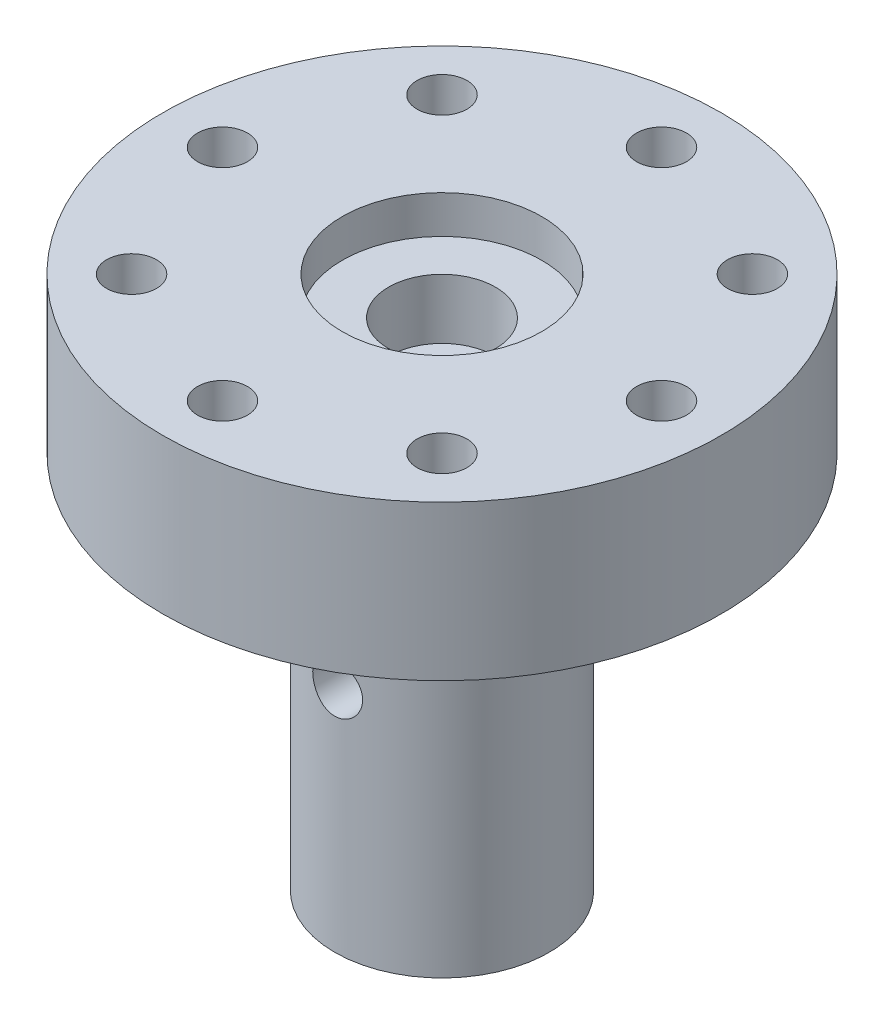
ISO-10303-21;
HEADER;
FILE_DESCRIPTION(('STEP AP214'),'2;1');
FILE_NAME('part.step','',(''),(''),'','','');
FILE_SCHEMA(('AUTOMOTIVE_DESIGN { 1 0 10303 214 1 1 1 1 }'));
ENDSEC;
DATA;
#1=APPLICATION_CONTEXT('core data for automotive mechanical design processes');
#2=APPLICATION_PROTOCOL_DEFINITION('international standard','automotive_design',2000,#1);
#3=PRODUCT_CONTEXT('',#1,'mechanical');
#4=PRODUCT('Part','Part','',(#3));
#5=PRODUCT_RELATED_PRODUCT_CATEGORY('part','',(#4));
#6=PRODUCT_DEFINITION_FORMATION('','',#4);
#7=PRODUCT_DEFINITION_CONTEXT('part definition',#1,'design');
#8=PRODUCT_DEFINITION('design','',#6,#7);
#9=PRODUCT_DEFINITION_SHAPE('','',#8);
#10=(LENGTH_UNIT() NAMED_UNIT(*) SI_UNIT(.MILLI.,.METRE.));
#11=(NAMED_UNIT(*) PLANE_ANGLE_UNIT() SI_UNIT($,.RADIAN.));
#12=(NAMED_UNIT(*) SI_UNIT($,.STERADIAN.) SOLID_ANGLE_UNIT());
#13=UNCERTAINTY_MEASURE_WITH_UNIT(LENGTH_MEASURE(1.E-05),#10,'distance_accuracy_value','');
#14=(GEOMETRIC_REPRESENTATION_CONTEXT(3) GLOBAL_UNCERTAINTY_ASSIGNED_CONTEXT((#13)) GLOBAL_UNIT_ASSIGNED_CONTEXT((#10,
#11,#12)) REPRESENTATION_CONTEXT('',''));
#15=CARTESIAN_POINT('',(0.,0.,0.));
#16=DIRECTION('',(0.,0.,1.));
#17=DIRECTION('',(1.,0.,0.));
#18=AXIS2_PLACEMENT_3D('',#15,#16,#17);
#19=CARTESIAN_POINT('',(0.,0.,0.));
#20=DIRECTION('',(0.,1.,0.));
#21=DIRECTION('',(0.,0.,1.));
#22=AXIS2_PLACEMENT_3D('',#19,#20,#21);
#23=PLANE('',#22);
#24=CARTESIAN_POINT('',(-11.,0.,0.));
#25=DIRECTION('',(0.,1.,0.));
#26=DIRECTION('',(0.,0.,1.));
#27=AXIS2_PLACEMENT_3D('',#24,#25,#26);
#28=CIRCLE('',#27,1.25);
#29=CARTESIAN_POINT('',(-11.,0.,1.25));
#30=VERTEX_POINT('',#29);
#31=EDGE_CURVE('E151',#30,#30,#28,.T.);
#32=ORIENTED_EDGE('',*,*,#31,.T.);
#33=EDGE_LOOP('',(#32));
#34=FACE_BOUND('',#33,.T.);
#35=CARTESIAN_POINT('',(-1.15218884181823E-13,0.,11.));
#36=DIRECTION('',(0.,1.,0.));
#37=DIRECTION('',(0.,0.,1.));
#38=AXIS2_PLACEMENT_3D('',#35,#36,#37);
#39=CIRCLE('',#38,1.25);
#40=CARTESIAN_POINT('',(-1.15218884181823E-13,0.,12.25));
#41=VERTEX_POINT('',#40);
#42=EDGE_CURVE('E161',#41,#41,#39,.T.);
#43=ORIENTED_EDGE('',*,*,#42,.T.);
#44=EDGE_LOOP('',(#43));
#45=FACE_BOUND('',#44,.T.);
#46=CARTESIAN_POINT('',(11.,0.,0.));
#47=DIRECTION('',(0.,1.,0.));
#48=DIRECTION('',(0.,0.,1.));
#49=AXIS2_PLACEMENT_3D('',#46,#47,#48);
#50=CIRCLE('',#49,1.25);
#51=CARTESIAN_POINT('',(11.,0.,1.25000000000008));
#52=VERTEX_POINT('',#51);
#53=EDGE_CURVE('E173',#52,#52,#50,.T.);
#54=ORIENTED_EDGE('',*,*,#53,.T.);
#55=EDGE_LOOP('',(#54));
#56=FACE_BOUND('',#55,.T.);
#57=CARTESIAN_POINT('',(0.,0.,-11.));
#58=DIRECTION('',(0.,1.,0.));
#59=DIRECTION('',(0.,0.,1.));
#60=AXIS2_PLACEMENT_3D('',#57,#58,#59);
#61=CIRCLE('',#60,1.25);
#62=CARTESIAN_POINT('',(0.,0.,-9.75));
#63=VERTEX_POINT('',#62);
#64=EDGE_CURVE('E185',#63,#63,#61,.T.);
#65=ORIENTED_EDGE('',*,*,#64,.T.);
#66=EDGE_LOOP('',(#65));
#67=FACE_BOUND('',#66,.T.);
#68=CARTESIAN_POINT('',(0.,0.,0.));
#69=DIRECTION('',(0.,1.,0.));
#70=DIRECTION('',(0.,0.,1.));
#71=AXIS2_PLACEMENT_3D('',#68,#69,#70);
#72=CIRCLE('',#71,14.);
#73=CARTESIAN_POINT('',(0.,0.,14.));
#74=VERTEX_POINT('',#73);
#75=EDGE_CURVE('E52',#74,#74,#72,.T.);
#76=ORIENTED_EDGE('',*,*,#75,.F.);
#77=EDGE_LOOP('',(#76));
#78=FACE_BOUND('',#77,.T.);
#79=CARTESIAN_POINT('',(-7.77817459305201,0.,-7.77817459305203));
#80=DIRECTION('',(0.,1.,0.));
#81=DIRECTION('',(0.,0.,1.));
#82=AXIS2_PLACEMENT_3D('',#79,#80,#81);
#83=CIRCLE('',#82,1.25);
#84=CARTESIAN_POINT('',(-7.77817459305201,0.,-6.52817459305203));
#85=VERTEX_POINT('',#84);
#86=EDGE_CURVE('E191',#85,#85,#83,.T.);
#87=ORIENTED_EDGE('',*,*,#86,.T.);
#88=EDGE_LOOP('',(#87));
#89=FACE_BOUND('',#88,.T.);
#90=CARTESIAN_POINT('',(7.77817459305206,0.,-7.77817459305199));
#91=DIRECTION('',(0.,1.,0.));
#92=DIRECTION('',(0.,0.,1.));
#93=AXIS2_PLACEMENT_3D('',#90,#91,#92);
#94=CIRCLE('',#93,1.25);
#95=CARTESIAN_POINT('',(7.77817459305206,0.,-6.52817459305199));
#96=VERTEX_POINT('',#95);
#97=EDGE_CURVE('E179',#96,#96,#94,.T.);
#98=ORIENTED_EDGE('',*,*,#97,.T.);
#99=EDGE_LOOP('',(#98));
#100=FACE_BOUND('',#99,.T.);
#101=CARTESIAN_POINT('',(7.77817459305195,0.,7.77817459305209));
#102=DIRECTION('',(0.,1.,0.));
#103=DIRECTION('',(0.,0.,1.));
#104=AXIS2_PLACEMENT_3D('',#101,#102,#103);
#105=CIRCLE('',#104,1.25);
#106=CARTESIAN_POINT('',(7.77817459305195,0.,9.02817459305209));
#107=VERTEX_POINT('',#106);
#108=EDGE_CURVE('E167',#107,#107,#105,.T.);
#109=ORIENTED_EDGE('',*,*,#108,.T.);
#110=EDGE_LOOP('',(#109));
#111=FACE_BOUND('',#110,.T.);
#112=CARTESIAN_POINT('',(-7.77817459305212,0.,7.77817459305193));
#113=DIRECTION('',(0.,1.,0.));
#114=DIRECTION('',(0.,0.,1.));
#115=AXIS2_PLACEMENT_3D('',#112,#113,#114);
#116=CIRCLE('',#115,1.25);
#117=CARTESIAN_POINT('',(-7.77817459305212,0.,9.02817459305193));
#118=VERTEX_POINT('',#117);
#119=EDGE_CURVE('E156',#118,#118,#116,.T.);
#120=ORIENTED_EDGE('',*,*,#119,.T.);
#121=EDGE_LOOP('',(#120));
#122=FACE_BOUND('',#121,.T.);
#123=CARTESIAN_POINT('',(0.,0.,0.));
#124=DIRECTION('',(0.,1.,0.));
#125=DIRECTION('',(0.,0.,1.));
#126=AXIS2_PLACEMENT_3D('',#123,#124,#125);
#127=CIRCLE('',#126,5.375);
#128=CARTESIAN_POINT('',(0.,0.,5.375));
#129=VERTEX_POINT('',#128);
#130=EDGE_CURVE('E10',#129,#129,#127,.F.);
#131=ORIENTED_EDGE('',*,*,#130,.F.);
#132=EDGE_LOOP('',(#131));
#133=FACE_BOUND('',#132,.T.);
#134=ADVANCED_FACE('F34',(#34,#45,#56,#67,#78,#89,#100,#111,#122,#133),#23,.F.);
#135=CARTESIAN_POINT('',(0.,7.75,0.));
#136=DIRECTION('',(0.,1.,0.));
#137=DIRECTION('',(0.,0.,1.));
#138=AXIS2_PLACEMENT_3D('',#135,#136,#137);
#139=PLANE('',#138);
#140=CARTESIAN_POINT('',(0.,7.75,0.));
#141=DIRECTION('',(0.,1.,0.));
#142=DIRECTION('',(0.,0.,1.));
#143=AXIS2_PLACEMENT_3D('',#140,#141,#142);
#144=CIRCLE('',#143,5.);
#145=CARTESIAN_POINT('',(0.,7.75,5.));
#146=VERTEX_POINT('',#145);
#147=EDGE_CURVE('E139',#146,#146,#144,.T.);
#148=ORIENTED_EDGE('',*,*,#147,.F.);
#149=EDGE_LOOP('',(#148));
#150=FACE_BOUND('',#149,.T.);
#151=CARTESIAN_POINT('',(-7.77817459305212,7.75,7.77817459305193));
#152=DIRECTION('',(0.,1.,0.));
#153=DIRECTION('',(0.,0.,1.));
#154=AXIS2_PLACEMENT_3D('',#151,#152,#153);
#155=CIRCLE('',#154,1.25);
#156=CARTESIAN_POINT('',(-7.77817459305212,7.75,9.02817459305193));
#157=VERTEX_POINT('',#156);
#158=EDGE_CURVE('E158',#157,#157,#155,.T.);
#159=ORIENTED_EDGE('',*,*,#158,.F.);
#160=EDGE_LOOP('',(#159));
#161=FACE_BOUND('',#160,.T.);
#162=CARTESIAN_POINT('',(7.77817459305195,7.75,7.77817459305209));
#163=DIRECTION('',(0.,1.,0.));
#164=DIRECTION('',(0.,0.,1.));
#165=AXIS2_PLACEMENT_3D('',#162,#163,#164);
#166=CIRCLE('',#165,1.25);
#167=CARTESIAN_POINT('',(7.77817459305195,7.75,9.02817459305209));
#168=VERTEX_POINT('',#167);
#169=EDGE_CURVE('E170',#168,#168,#166,.T.);
#170=ORIENTED_EDGE('',*,*,#169,.F.);
#171=EDGE_LOOP('',(#170));
#172=FACE_BOUND('',#171,.T.);
#173=CARTESIAN_POINT('',(7.77817459305206,7.75,-7.77817459305199));
#174=DIRECTION('',(0.,1.,0.));
#175=DIRECTION('',(0.,0.,1.));
#176=AXIS2_PLACEMENT_3D('',#173,#174,#175);
#177=CIRCLE('',#176,1.25);
#178=CARTESIAN_POINT('',(7.77817459305206,7.75,-6.52817459305199));
#179=VERTEX_POINT('',#178);
#180=EDGE_CURVE('E182',#179,#179,#177,.T.);
#181=ORIENTED_EDGE('',*,*,#180,.F.);
#182=EDGE_LOOP('',(#181));
#183=FACE_BOUND('',#182,.T.);
#184=CARTESIAN_POINT('',(-7.77817459305201,7.75,-7.77817459305203));
#185=DIRECTION('',(0.,1.,0.));
#186=DIRECTION('',(0.,0.,1.));
#187=AXIS2_PLACEMENT_3D('',#184,#185,#186);
#188=CIRCLE('',#187,1.25);
#189=CARTESIAN_POINT('',(-7.77817459305201,7.75,-6.52817459305203));
#190=VERTEX_POINT('',#189);
#191=EDGE_CURVE('E194',#190,#190,#188,.T.);
#192=ORIENTED_EDGE('',*,*,#191,.F.);
#193=EDGE_LOOP('',(#192));
#194=FACE_BOUND('',#193,.T.);
#195=CARTESIAN_POINT('',(0.,7.75,0.));
#196=DIRECTION('',(0.,1.,0.));
#197=DIRECTION('',(0.,0.,1.));
#198=AXIS2_PLACEMENT_3D('',#195,#196,#197);
#199=CIRCLE('',#198,14.);
#200=CARTESIAN_POINT('',(0.,7.75,14.));
#201=VERTEX_POINT('',#200);
#202=EDGE_CURVE('E47',#201,#201,#199,.T.);
#203=ORIENTED_EDGE('',*,*,#202,.T.);
#204=EDGE_LOOP('',(#203));
#205=FACE_BOUND('',#204,.T.);
#206=CARTESIAN_POINT('',(0.,7.75,-11.));
#207=DIRECTION('',(0.,1.,0.));
#208=DIRECTION('',(0.,0.,1.));
#209=AXIS2_PLACEMENT_3D('',#206,#207,#208);
#210=CIRCLE('',#209,1.25);
#211=CARTESIAN_POINT('',(0.,7.75,-9.75));
#212=VERTEX_POINT('',#211);
#213=EDGE_CURVE('E188',#212,#212,#210,.T.);
#214=ORIENTED_EDGE('',*,*,#213,.F.);
#215=EDGE_LOOP('',(#214));
#216=FACE_BOUND('',#215,.T.);
#217=CARTESIAN_POINT('',(11.,7.75,0.));
#218=DIRECTION('',(0.,1.,0.));
#219=DIRECTION('',(0.,0.,1.));
#220=AXIS2_PLACEMENT_3D('',#217,#218,#219);
#221=CIRCLE('',#220,1.25);
#222=CARTESIAN_POINT('',(11.,7.75,1.25000000000008));
#223=VERTEX_POINT('',#222);
#224=EDGE_CURVE('E176',#223,#223,#221,.T.);
#225=ORIENTED_EDGE('',*,*,#224,.F.);
#226=EDGE_LOOP('',(#225));
#227=FACE_BOUND('',#226,.T.);
#228=CARTESIAN_POINT('',(-1.15218884181823E-13,7.75,11.));
#229=DIRECTION('',(0.,1.,0.));
#230=DIRECTION('',(0.,0.,1.));
#231=AXIS2_PLACEMENT_3D('',#228,#229,#230);
#232=CIRCLE('',#231,1.25);
#233=CARTESIAN_POINT('',(-1.15218884181823E-13,7.75,12.25));
#234=VERTEX_POINT('',#233);
#235=EDGE_CURVE('E164',#234,#234,#232,.T.);
#236=ORIENTED_EDGE('',*,*,#235,.F.);
#237=EDGE_LOOP('',(#236));
#238=FACE_BOUND('',#237,.T.);
#239=CARTESIAN_POINT('',(-11.,7.75,0.));
#240=DIRECTION('',(0.,1.,0.));
#241=DIRECTION('',(0.,0.,1.));
#242=AXIS2_PLACEMENT_3D('',#239,#240,#241);
#243=CIRCLE('',#242,1.25);
#244=CARTESIAN_POINT('',(-11.,7.75,1.25));
#245=VERTEX_POINT('',#244);
#246=EDGE_CURVE('E153',#245,#245,#243,.T.);
#247=ORIENTED_EDGE('',*,*,#246,.F.);
#248=EDGE_LOOP('',(#247));
#249=FACE_BOUND('',#248,.T.);
#250=ADVANCED_FACE('F79',(#150,#161,#172,#183,#194,#205,#216,#227,#238,#249),#139,.T.);
#251=CARTESIAN_POINT('',(0.,7.75,0.));
#252=DIRECTION('',(0.,-1.,0.));
#253=DIRECTION('',(0.,0.,-1.));
#254=AXIS2_PLACEMENT_3D('',#251,#252,#253);
#255=CYLINDRICAL_SURFACE('',#254,14.);
#256=ORIENTED_EDGE('',*,*,#202,.F.);
#257=EDGE_LOOP('',(#256));
#258=FACE_BOUND('',#257,.T.);
#259=ORIENTED_EDGE('',*,*,#75,.T.);
#260=EDGE_LOOP('',(#259));
#261=FACE_BOUND('',#260,.T.);
#262=ADVANCED_FACE('F36',(#258,#261),#255,.T.);
#263=CARTESIAN_POINT('',(-7.77817459305201,7.75,-7.77817459305203));
#264=DIRECTION('',(0.,-1.,0.));
#265=DIRECTION('',(0.,0.,-1.));
#266=AXIS2_PLACEMENT_3D('',#263,#264,#265);
#267=CYLINDRICAL_SURFACE('',#266,1.25);
#268=ORIENTED_EDGE('',*,*,#191,.T.);
#269=EDGE_LOOP('',(#268));
#270=FACE_BOUND('',#269,.T.);
#271=ORIENTED_EDGE('',*,*,#86,.F.);
#272=EDGE_LOOP('',(#271));
#273=FACE_BOUND('',#272,.T.);
#274=ADVANCED_FACE('F89',(#270,#273),#267,.F.);
#275=CARTESIAN_POINT('',(0.,7.75,-11.));
#276=DIRECTION('',(0.,-1.,0.));
#277=DIRECTION('',(0.,0.,-1.));
#278=AXIS2_PLACEMENT_3D('',#275,#276,#277);
#279=CYLINDRICAL_SURFACE('',#278,1.25);
#280=ORIENTED_EDGE('',*,*,#213,.T.);
#281=EDGE_LOOP('',(#280));
#282=FACE_BOUND('',#281,.T.);
#283=ORIENTED_EDGE('',*,*,#64,.F.);
#284=EDGE_LOOP('',(#283));
#285=FACE_BOUND('',#284,.T.);
#286=ADVANCED_FACE('F92',(#282,#285),#279,.F.);
#287=CARTESIAN_POINT('',(7.77817459305206,7.75,-7.77817459305199));
#288=DIRECTION('',(0.,-1.,0.));
#289=DIRECTION('',(0.,0.,-1.));
#290=AXIS2_PLACEMENT_3D('',#287,#288,#289);
#291=CYLINDRICAL_SURFACE('',#290,1.25);
#292=ORIENTED_EDGE('',*,*,#180,.T.);
#293=EDGE_LOOP('',(#292));
#294=FACE_BOUND('',#293,.T.);
#295=ORIENTED_EDGE('',*,*,#97,.F.);
#296=EDGE_LOOP('',(#295));
#297=FACE_BOUND('',#296,.T.);
#298=ADVANCED_FACE('F96',(#294,#297),#291,.F.);
#299=CARTESIAN_POINT('',(11.,7.75,0.));
#300=DIRECTION('',(0.,-1.,0.));
#301=DIRECTION('',(0.,0.,-1.));
#302=AXIS2_PLACEMENT_3D('',#299,#300,#301);
#303=CYLINDRICAL_SURFACE('',#302,1.25);
#304=ORIENTED_EDGE('',*,*,#224,.T.);
#305=EDGE_LOOP('',(#304));
#306=FACE_BOUND('',#305,.T.);
#307=ORIENTED_EDGE('',*,*,#53,.F.);
#308=EDGE_LOOP('',(#307));
#309=FACE_BOUND('',#308,.T.);
#310=ADVANCED_FACE('F100',(#306,#309),#303,.F.);
#311=CARTESIAN_POINT('',(7.77817459305195,7.75,7.77817459305209));
#312=DIRECTION('',(0.,-1.,0.));
#313=DIRECTION('',(0.,0.,-1.));
#314=AXIS2_PLACEMENT_3D('',#311,#312,#313);
#315=CYLINDRICAL_SURFACE('',#314,1.25);
#316=ORIENTED_EDGE('',*,*,#169,.T.);
#317=EDGE_LOOP('',(#316));
#318=FACE_BOUND('',#317,.T.);
#319=ORIENTED_EDGE('',*,*,#108,.F.);
#320=EDGE_LOOP('',(#319));
#321=FACE_BOUND('',#320,.T.);
#322=ADVANCED_FACE('F104',(#318,#321),#315,.F.);
#323=CARTESIAN_POINT('',(-1.15218884181823E-13,7.75,11.));
#324=DIRECTION('',(0.,-1.,0.));
#325=DIRECTION('',(0.,0.,-1.));
#326=AXIS2_PLACEMENT_3D('',#323,#324,#325);
#327=CYLINDRICAL_SURFACE('',#326,1.25);
#328=ORIENTED_EDGE('',*,*,#235,.T.);
#329=EDGE_LOOP('',(#328));
#330=FACE_BOUND('',#329,.T.);
#331=ORIENTED_EDGE('',*,*,#42,.F.);
#332=EDGE_LOOP('',(#331));
#333=FACE_BOUND('',#332,.T.);
#334=ADVANCED_FACE('F108',(#330,#333),#327,.F.);
#335=CARTESIAN_POINT('',(-7.77817459305212,7.75,7.77817459305193));
#336=DIRECTION('',(0.,-1.,0.));
#337=DIRECTION('',(0.,0.,-1.));
#338=AXIS2_PLACEMENT_3D('',#335,#336,#337);
#339=CYLINDRICAL_SURFACE('',#338,1.25);
#340=ORIENTED_EDGE('',*,*,#158,.T.);
#341=EDGE_LOOP('',(#340));
#342=FACE_BOUND('',#341,.T.);
#343=ORIENTED_EDGE('',*,*,#119,.F.);
#344=EDGE_LOOP('',(#343));
#345=FACE_BOUND('',#344,.T.);
#346=ADVANCED_FACE('F112',(#342,#345),#339,.F.);
#347=CARTESIAN_POINT('',(-11.,7.75,0.));
#348=DIRECTION('',(0.,-1.,0.));
#349=DIRECTION('',(0.,0.,-1.));
#350=AXIS2_PLACEMENT_3D('',#347,#348,#349);
#351=CYLINDRICAL_SURFACE('',#350,1.25);
#352=ORIENTED_EDGE('',*,*,#246,.T.);
#353=EDGE_LOOP('',(#352));
#354=FACE_BOUND('',#353,.T.);
#355=ORIENTED_EDGE('',*,*,#31,.F.);
#356=EDGE_LOOP('',(#355));
#357=FACE_BOUND('',#356,.T.);
#358=ADVANCED_FACE('F116',(#354,#357),#351,.F.);
#359=CARTESIAN_POINT('',(0.,5.85,0.));
#360=DIRECTION('',(0.,1.,0.));
#361=DIRECTION('',(0.,0.,1.));
#362=AXIS2_PLACEMENT_3D('',#359,#360,#361);
#363=CYLINDRICAL_SURFACE('',#362,5.);
#364=CARTESIAN_POINT('',(0.,5.85,0.));
#365=DIRECTION('',(0.,1.,0.));
#366=DIRECTION('',(0.,0.,1.));
#367=AXIS2_PLACEMENT_3D('',#364,#365,#366);
#368=CIRCLE('',#367,5.);
#369=CARTESIAN_POINT('',(0.,5.85,5.));
#370=VERTEX_POINT('',#369);
#371=EDGE_CURVE('E143',#370,#370,#368,.T.);
#372=ORIENTED_EDGE('',*,*,#371,.F.);
#373=EDGE_LOOP('',(#372));
#374=FACE_BOUND('',#373,.T.);
#375=ORIENTED_EDGE('',*,*,#147,.T.);
#376=EDGE_LOOP('',(#375));
#377=FACE_BOUND('',#376,.T.);
#378=ADVANCED_FACE('F120',(#374,#377),#363,.F.);
#379=CARTESIAN_POINT('',(0.,5.85,0.));
#380=DIRECTION('',(0.,1.,0.));
#381=DIRECTION('',(0.,0.,1.));
#382=AXIS2_PLACEMENT_3D('',#379,#380,#381);
#383=PLANE('',#382);
#384=CARTESIAN_POINT('',(0.,5.85,0.));
#385=DIRECTION('',(0.,1.,0.));
#386=DIRECTION('',(0.,0.,1.));
#387=AXIS2_PLACEMENT_3D('',#384,#385,#386);
#388=CIRCLE('',#387,2.675);
#389=CARTESIAN_POINT('',(0.,5.85,2.675));
#390=VERTEX_POINT('',#389);
#391=EDGE_CURVE('E140',#390,#390,#388,.T.);
#392=ORIENTED_EDGE('',*,*,#391,.F.);
#393=EDGE_LOOP('',(#392));
#394=FACE_BOUND('',#393,.T.);
#395=ORIENTED_EDGE('',*,*,#371,.T.);
#396=EDGE_LOOP('',(#395));
#397=FACE_BOUND('',#396,.T.);
#398=ADVANCED_FACE('F124',(#394,#397),#383,.T.);
#399=CARTESIAN_POINT('',(0.,2.85,0.));
#400=DIRECTION('',(0.,1.,0.));
#401=DIRECTION('',(0.,0.,1.));
#402=AXIS2_PLACEMENT_3D('',#399,#400,#401);
#403=CYLINDRICAL_SURFACE('',#402,2.675);
#404=CARTESIAN_POINT('',(0.,2.85,0.));
#405=DIRECTION('',(0.,1.,0.));
#406=DIRECTION('',(0.,0.,1.));
#407=AXIS2_PLACEMENT_3D('',#404,#405,#406);
#408=CIRCLE('',#407,2.675);
#409=CARTESIAN_POINT('',(0.,2.85,2.675));
#410=VERTEX_POINT('',#409);
#411=EDGE_CURVE('E138',#410,#410,#408,.T.);
#412=ORIENTED_EDGE('',*,*,#411,.F.);
#413=EDGE_LOOP('',(#412));
#414=FACE_BOUND('',#413,.T.);
#415=ORIENTED_EDGE('',*,*,#391,.T.);
#416=EDGE_LOOP('',(#415));
#417=FACE_BOUND('',#416,.T.);
#418=ADVANCED_FACE('F128',(#414,#417),#403,.F.);
#419=CARTESIAN_POINT('',(0.,2.85,0.));
#420=DIRECTION('',(0.,1.,0.));
#421=DIRECTION('',(0.,0.,1.));
#422=AXIS2_PLACEMENT_3D('',#419,#420,#421);
#423=PLANE('',#422);
#424=ORIENTED_EDGE('',*,*,#411,.T.);
#425=EDGE_LOOP('',(#424));
#426=FACE_BOUND('',#425,.T.);
#427=ADVANCED_FACE('F75',(#426),#423,.T.);
#428=CARTESIAN_POINT('',(0.,-19.,0.));
#429=DIRECTION('',(0.,1.,0.));
#430=DIRECTION('',(0.,0.,1.));
#431=AXIS2_PLACEMENT_3D('',#428,#429,#430);
#432=CYLINDRICAL_SURFACE('',#431,5.375);
#433=CARTESIAN_POINT('',(0.,-8.75,5.375));
#434=CARTESIAN_POINT('',(-0.0692151507875184,-8.7499978025309,5.37499875159576));
#435=CARTESIAN_POINT('',(-0.138455956736741,-8.74423173051015,5.37364957601175));
#436=CARTESIAN_POINT('',(-0.274963229392266,-8.72134823846589,5.36839792851223));
#437=CARTESIAN_POINT('',(-0.342228380276212,-8.70422342465732,5.3644937935103));
#438=CARTESIAN_POINT('',(-0.47279246909182,-8.65919380930274,5.35456591410619));
#439=CARTESIAN_POINT('',(-0.536095726882453,-8.63130099532277,5.34854452741455));
#440=CARTESIAN_POINT('',(-0.65712302733579,-8.56556700357688,5.33502833023856));
#441=CARTESIAN_POINT('',(-0.714847069776669,-8.52772582541541,5.32753351969561));
#442=CARTESIAN_POINT('',(-0.82411767932015,-8.44244896995872,5.3117375273922));
#443=CARTESIAN_POINT('',(-0.875549458901755,-8.39486824718393,5.30342527996824));
#444=CARTESIAN_POINT('',(-0.969779244250178,-8.29177397256851,5.2870072881596));
#445=CARTESIAN_POINT('',(-1.01257639711149,-8.23625963799111,5.27890156424379));
#446=CARTESIAN_POINT('',(-1.08884272508293,-8.11800711008904,5.26370428272459));
#447=CARTESIAN_POINT('',(-1.122187054859,-8.05518641966315,5.25662685117825));
#448=CARTESIAN_POINT('',(-1.17779954036633,-7.92464094384012,5.24444745901717));
#449=CARTESIAN_POINT('',(-1.20006920803617,-7.85691682931684,5.23934522876444));
#450=CARTESIAN_POINT('',(-1.23251560906288,-7.71973961753334,5.2318071002124));
#451=CARTESIAN_POINT('',(-1.24289695564103,-7.65033744805585,5.22932614611082));
#452=CARTESIAN_POINT('',(-1.25190874128498,-7.51073562534051,5.22717635501667));
#453=CARTESIAN_POINT('',(-1.25054082146171,-7.44053608484554,5.22750712528875));
#454=CARTESIAN_POINT('',(-1.23625696098787,-7.30287312046419,5.23090274142344));
#455=CARTESIAN_POINT('',(-1.22358128455204,-7.2353831482708,5.23391070005962));
#456=CARTESIAN_POINT('',(-1.18742349566998,-7.10351477953371,5.24223152686078));
#457=CARTESIAN_POINT('',(-1.16394070657715,-7.03913657810075,5.24754453934681));
#458=CARTESIAN_POINT('',(-1.10662151135297,-6.91465713559703,5.25993123752095));
#459=CARTESIAN_POINT('',(-1.07269494932043,-6.85459898726474,5.26702015035257));
#460=CARTESIAN_POINT('',(-0.995514496684479,-6.74094037323062,5.28215089234227));
#461=CARTESIAN_POINT('',(-0.952259179024089,-6.68734089749527,5.29019286720917));
#462=CARTESIAN_POINT('',(-0.85638886172877,-6.58674048835362,5.30656575957393));
#463=CARTESIAN_POINT('',(-0.803570198890892,-6.53993379387511,5.3148989243812));
#464=CARTESIAN_POINT('',(-0.690736062170002,-6.45580853851922,5.33073627503209));
#465=CARTESIAN_POINT('',(-0.630720422805096,-6.41849019587148,5.33824044180673));
#466=CARTESIAN_POINT('',(-0.504941835859097,-6.35434315943301,5.35160386178591));
#467=CARTESIAN_POINT('',(-0.43916408642512,-6.32754251139414,5.3574587054603));
#468=CARTESIAN_POINT('',(-0.303871544378256,-6.28543045650119,5.3668313901215));
#469=CARTESIAN_POINT('',(-0.234357369928456,-6.27011715538449,5.37034961640536));
#470=CARTESIAN_POINT('',(-0.0952290121857286,-6.25170300814094,5.37459688291296));
#471=CARTESIAN_POINT('',(-0.025651696845909,-6.24833719077728,5.37538642917406));
#472=CARTESIAN_POINT('',(0.113071309495127,-6.25319171444632,5.3742581143193));
#473=CARTESIAN_POINT('',(0.18221703340258,-6.26141116106119,5.37234046220743));
#474=CARTESIAN_POINT('',(0.317217837058148,-6.28898365879917,5.36605166320075));
#475=CARTESIAN_POINT('',(0.383103370534299,-6.30819534709708,5.36171168503793));
#476=CARTESIAN_POINT('',(0.510715394590336,-6.35704813126426,5.35106517330135));
#477=CARTESIAN_POINT('',(0.572441500060785,-6.38669019127502,5.34475845793648));
#478=CARTESIAN_POINT('',(0.691060582292075,-6.4560977987617,5.33073045297445));
#479=CARTESIAN_POINT('',(0.747861769182145,-6.49601592069626,5.32298838444375));
#480=CARTESIAN_POINT('',(0.854054068349471,-6.5846441797903,5.30698648156409));
#481=CARTESIAN_POINT('',(0.903444081598189,-6.63335561858621,5.29872657067948));
#482=CARTESIAN_POINT('',(0.994478847710012,-6.73941034024425,5.28240709620801));
#483=CARTESIAN_POINT('',(1.03593901887591,-6.7969135108285,5.27435539090911));
#484=CARTESIAN_POINT('',(1.10861684709578,-6.91822068380326,5.25956031697033));
#485=CARTESIAN_POINT('',(1.13983496068385,-6.98202440518521,5.25281689002014));
#486=CARTESIAN_POINT('',(1.19091990903248,-7.11377322580029,5.2414711614034));
#487=CARTESIAN_POINT('',(1.21085295728779,-7.18169152381724,5.236856400335));
#488=CARTESIAN_POINT('',(1.23898888372022,-7.32003650748142,5.23027190554712));
#489=CARTESIAN_POINT('',(1.24719392433216,-7.39046272825755,5.22830168422589));
#490=CARTESIAN_POINT('',(1.25153973194479,-7.52995635750029,5.22726287112187));
#491=CARTESIAN_POINT('',(1.24797409140692,-7.59901425103841,5.22812366420748));
#492=CARTESIAN_POINT('',(1.22954275309423,-7.73551569563618,5.23248866490602));
#493=CARTESIAN_POINT('',(1.21467722619878,-7.80295927109198,5.23599283254526));
#494=CARTESIAN_POINT('',(1.17421809290322,-7.93404767410398,5.24521316682076));
#495=CARTESIAN_POINT('',(1.1486725000026,-7.99770806440233,5.25091942497235));
#496=CARTESIAN_POINT('',(1.08761782054051,-8.11988112782559,5.2639037122052));
#497=CARTESIAN_POINT('',(1.05210754397903,-8.17839318503061,5.2711819289886));
#498=CARTESIAN_POINT('',(0.971180588478164,-8.29004391984119,5.28669691942429));
#499=CARTESIAN_POINT('',(0.925556988894283,-8.34303013843883,5.29495172792319));
#500=CARTESIAN_POINT('',(0.826111068605686,-8.44069041608503,5.31137463958233));
#501=CARTESIAN_POINT('',(0.772286837866884,-8.48536253327186,5.31954272206761));
#502=CARTESIAN_POINT('',(0.656987722383672,-8.56577747734228,5.33501850182159));
#503=CARTESIAN_POINT('',(0.595409645644401,-8.60137538930645,5.34231135596834));
#504=CARTESIAN_POINT('',(0.46698357330058,-8.66165811880061,5.35506311977135));
#505=CARTESIAN_POINT('',(0.40013977646351,-8.68635152959375,5.36052347270783));
#506=CARTESIAN_POINT('',(0.277753131460168,-8.7200334011924,5.36809110179261));
#507=CARTESIAN_POINT('',(0.22284097782472,-8.73124825503955,5.37066516026247));
#508=CARTESIAN_POINT('',(0.111958105122188,-8.74623223410712,5.37412006672818));
#509=CARTESIAN_POINT('',(0.0559874456868497,-8.75000177751085,5.37500100982175));
#510=CARTESIAN_POINT('',(0.,-8.75,5.375));
#511=B_SPLINE_CURVE_WITH_KNOTS('',3,(#433,#434,#435,#436,#437,#438,#439,#440,#441,#442,#443,
#444,#445,#446,#447,#448,#449,#450,#451,#452,#453,#454,#455,#456,#457,#458,#459,#460,#461,#462,
#463,#464,#465,#466,#467,#468,#469,#470,#471,#472,#473,#474,#475,#476,#477,#478,#479,#480,#481,
#482,#483,#484,#485,#486,#487,#488,#489,#490,#491,#492,#493,#494,#495,#496,#497,#498,#499,#500,
#501,#502,#503,#504,#505,#506,#507,#508,#509,#510),.UNSPECIFIED.,.T.,.F.,(4,2,2,2,2,2,2,2,2,2,2,
2,2,2,2,2,2,2,2,2,2,2,2,2,2,2,2,2,2,2,2,2,2,2,2,2,2,2,4),(0.,0.207440417103945,
0.415015996803991,0.62236115455932,0.829706320558518,1.04039922313264,1.2511129272142,
1.46449211731239,1.67784216838555,1.887462233859,2.09705302055257,2.30229382661907,
2.50754748481328,2.71462518988682,2.92173459496075,3.1339271935358,3.34612467204454,
3.55888419817218,3.77160863255363,3.9795847243529,4.187544760641,4.39288863582478,
4.59825149715664,4.80685961033016,5.01549862821383,5.22852225725064,5.4415363895857,
5.65328738316594,5.86499932861198,6.0714708987445,6.27793934663075,6.48348940590648,
6.6890640227853,6.89931369625044,7.10961241468294,7.32308453516627,7.53638812799018,
7.70419403955388,7.87199052563708),.UNSPECIFIED.);
#512=CARTESIAN_POINT('',(0.,-8.75,5.375));
#513=VERTEX_POINT('',#512);
#514=EDGE_CURVE('E38',#513,#513,#511,.T.);
#515=ORIENTED_EDGE('',*,*,#514,.T.);
#516=EDGE_LOOP('',(#515));
#517=FACE_BOUND('',#516,.T.);
#518=CARTESIAN_POINT('',(1.25,-7.5,-5.22763091658162));
#519=CARTESIAN_POINT('',(1.24999778347903,-7.43081338462086,-5.22763230124413));
#520=CARTESIAN_POINT('',(1.24423630278213,-7.36160106974779,-5.22901940032487));
#521=CARTESIAN_POINT('',(1.2213726981515,-7.22515292404002,-5.23440605446415));
#522=CARTESIAN_POINT('',(1.20426306260307,-7.15791843318024,-5.23840733988878));
#523=CARTESIAN_POINT('',(1.15927780925659,-7.02741933353806,-5.24854524685445));
#524=CARTESIAN_POINT('',(1.13141488887832,-6.9641501445858,-5.25467934913382));
#525=CARTESIAN_POINT('',(1.06575139892513,-6.84318045286964,-5.26838865902693));
#526=CARTESIAN_POINT('',(1.02795076275511,-6.78547998742667,-5.27596387629785));
#527=CARTESIAN_POINT('',(0.942715785204503,-6.67618496002803,-5.29186341835914));
#528=CARTESIAN_POINT('',(0.895127277906659,-6.6247121492262,-5.30019836616819));
#529=CARTESIAN_POINT('',(0.791999928596098,-6.53040254562183,-5.31658560025749));
#530=CARTESIAN_POINT('',(0.736460417828374,-6.48756647998234,-5.3246378626902));
#531=CARTESIAN_POINT('',(0.618183655154112,-6.41125763320687,-5.33966895039391));
#532=CARTESIAN_POINT('',(0.555368224386914,-6.37790303215156,-5.34663377727743));
#533=CARTESIAN_POINT('',(0.424834066609954,-6.32227013324566,-5.3585847385408));
#534=CARTESIAN_POINT('',(0.357115964412602,-6.29999042681121,-5.36357112453654));
#535=CARTESIAN_POINT('',(0.219966199931173,-6.26752570913751,-5.37092829221228));
#536=CARTESIAN_POINT('',(0.150585819872227,-6.25713432652508,-5.37334365155583));
#537=CARTESIAN_POINT('',(0.011027331365955,-6.24809490451041,-5.37544145142493));
#538=CARTESIAN_POINT('',(-0.0591506732672573,-6.24944535395125,-5.375124243628));
#539=CARTESIAN_POINT('',(-0.19688598162701,-6.26369980779501,-5.37182634158832));
#540=CARTESIAN_POINT('',(-0.264467730792642,-6.27638124075534,-5.36889695978885));
#541=CARTESIAN_POINT('',(-0.396516596776354,-6.31258169632147,-5.36076285399525));
#542=CARTESIAN_POINT('',(-0.460983561158552,-6.33610124874662,-5.35555801876665));
#543=CARTESIAN_POINT('',(-0.585577255041267,-6.39349993768058,-5.34337701123399));
#544=CARTESIAN_POINT('',(-0.645664717578549,-6.42746122381631,-5.33638686976437));
#545=CARTESIAN_POINT('',(-0.759367607659788,-6.50471766073246,-5.32139827385208));
#546=CARTESIAN_POINT('',(-0.812982045569571,-6.54801423593512,-5.31339966561025));
#547=CARTESIAN_POINT('',(-0.913542513947872,-6.64391620975245,-5.29704870110869));
#548=CARTESIAN_POINT('',(-0.960302397348203,-6.69671632130281,-5.28869244859633));
#549=CARTESIAN_POINT('',(-1.04434172554157,-6.80949589572208,-5.27274220502987));
#550=CARTESIAN_POINT('',(-1.08162084071429,-6.86947560809945,-5.26514824048398));
#551=CARTESIAN_POINT('',(-1.14573839237506,-6.9952398872415,-5.25157039701963));
#552=CARTESIAN_POINT('',(-1.17253757508656,-7.0610451673224,-5.24559259693624));
#553=CARTESIAN_POINT('',(-1.21463849952018,-7.19639817518247,-5.23600510574022));
#554=CARTESIAN_POINT('',(-1.22994233164607,-7.26594522006388,-5.23239498408572));
#555=CARTESIAN_POINT('',(-1.24832089430714,-7.40509578621641,-5.22804054181781));
#556=CARTESIAN_POINT('',(-1.25166845258668,-7.47466131577793,-5.22723229855295));
#557=CARTESIAN_POINT('',(-1.24678163745835,-7.61335656687351,-5.22840001935786));
#558=CARTESIAN_POINT('',(-1.23854817305386,-7.68248632218403,-5.23037576491023));
#559=CARTESIAN_POINT('',(-1.21097085422465,-7.81737105695104,-5.23682809669174));
#560=CARTESIAN_POINT('',(-1.19178089520811,-7.88315931385132,-5.24127001953437));
#561=CARTESIAN_POINT('',(-1.14300364035633,-8.01058627229767,-5.2521222431034));
#562=CARTESIAN_POINT('',(-1.11341524511984,-8.07222453425349,-5.25853275195453));
#563=CARTESIAN_POINT('',(-1.04409285184369,-8.19077197902784,-5.27273777995701));
#564=CARTESIAN_POINT('',(-1.00419289669985,-8.24758143187228,-5.28055423387871));
#565=CARTESIAN_POINT('',(-0.915593993390447,-8.35379869070764,-5.29663434800311));
#566=CARTESIAN_POINT('',(-0.866893802453078,-8.40320544948312,-5.3048980712537));
#567=CARTESIAN_POINT('',(-0.760834683593613,-8.49429345790518,-5.32115486563822));
#568=CARTESIAN_POINT('',(-0.703313271792079,-8.535787518466,-5.32913840875055));
#569=CARTESIAN_POINT('',(-0.581958914708238,-8.60852482042148,-5.34375133153831));
#570=CARTESIAN_POINT('',(-0.518126282498716,-8.63976856995877,-5.35038077833473));
#571=CARTESIAN_POINT('',(-0.386382166975894,-8.69086754791278,-5.36149882933157));
#572=CARTESIAN_POINT('',(-0.318501819970505,-8.71079976612134,-5.36600187036231));
#573=CARTESIAN_POINT('',(-0.180238248707514,-8.7389468216929,-5.3724225180654));
#574=CARTESIAN_POINT('',(-0.109855440607666,-8.7471635980718,-5.37434055257778));
#575=CARTESIAN_POINT('',(0.0296462760794785,-8.75154990813487,-5.37536033332193));
#576=CARTESIAN_POINT('',(0.0987561100322969,-8.74799748501603,-5.37452707935508));
#577=CARTESIAN_POINT('',(0.235365023813947,-8.72957452562812,-5.37027925059152));
#578=CARTESIAN_POINT('',(0.302864140227189,-8.71470424667564,-5.36686473448099));
#579=CARTESIAN_POINT('',(0.434087841530432,-8.67420802597031,-5.35784513640643));
#580=CARTESIAN_POINT('',(0.49782669809371,-8.64862619867007,-5.3522490454888));
#581=CARTESIAN_POINT('',(0.620142024079253,-8.58747441099571,-5.33946016952536));
#582=CARTESIAN_POINT('',(0.678717923845812,-8.55190335026583,-5.33226720859595));
#583=CARTESIAN_POINT('',(0.790385131780865,-8.47090121166638,-5.31687537508157));
#584=CARTESIAN_POINT('',(0.843334199668989,-8.4252774654047,-5.30865844161514));
#585=CARTESIAN_POINT('',(0.940919477784554,-8.32584754865422,-5.29223486118645));
#586=CARTESIAN_POINT('',(0.985553642556021,-8.27203937070315,-5.28402821724728));
#587=CARTESIAN_POINT('',(1.06591703923601,-8.15676055366037,-5.26841077021163));
#588=CARTESIAN_POINT('',(1.10149693815245,-8.09518373431897,-5.2610143338359));
#589=CARTESIAN_POINT('',(1.16174631650873,-7.96676258304721,-5.24804033294948));
#590=CARTESIAN_POINT('',(1.18642448742564,-7.89992249757133,-5.24246132042048));
#591=CARTESIAN_POINT('',(1.22007235744651,-7.77757380081096,-5.23471827146449));
#592=CARTESIAN_POINT('',(1.23127248641682,-7.72269783897858,-5.23207913053866));
#593=CARTESIAN_POINT('',(1.24623697127304,-7.61188680966607,-5.22853494746639));
#594=CARTESIAN_POINT('',(1.2500017925195,-7.55595180869025,-5.22762979679319));
#595=CARTESIAN_POINT('',(1.25,-7.5,-5.22763091658162));
#596=B_SPLINE_CURVE_WITH_KNOTS('',3,(#518,#519,#520,#521,#522,#523,#524,#525,#526,#527,#528,
#529,#530,#531,#532,#533,#534,#535,#536,#537,#538,#539,#540,#541,#542,#543,#544,#545,#546,#547,
#548,#549,#550,#551,#552,#553,#554,#555,#556,#557,#558,#559,#560,#561,#562,#563,#564,#565,#566,
#567,#568,#569,#570,#571,#572,#573,#574,#575,#576,#577,#578,#579,#580,#581,#582,#583,#584,#585,
#586,#587,#588,#589,#590,#591,#592,#593,#594,#595),.UNSPECIFIED.,.T.,.F.,(4,2,2,2,2,2,2,2,2,2,2,
2,2,2,2,2,2,2,2,2,2,2,2,2,2,2,2,2,2,2,2,2,2,2,2,2,2,2,4),(0.,0.207354618193562,
0.414846626519943,0.622094375350855,0.829343513035482,1.04014861143122,1.2509714509691,
1.46431710882169,1.67763562490919,1.88719207540974,2.09672155669535,2.30222364215106,
2.50773577460185,2.71490802692345,2.922111912959,3.1341812770046,3.34625801311301,
3.559121667599,3.77194660392831,3.97988295327035,4.18780298243932,4.39287198111783,
4.59796266776656,4.8065855469043,5.01523791088156,5.22833924756505,5.44143001849682,
5.65305247563378,5.86463990319453,6.07126462978709,6.27788465881307,6.48366198563355,
6.6894619885826,6.89961566570356,7.10982097230049,7.32329637301004,7.53660127047986,
7.70430122328014,7.87199067975419),.UNSPECIFIED.);
#597=CARTESIAN_POINT('',(1.25,-7.5,-5.22763091658162));
#598=VERTEX_POINT('',#597);
#599=EDGE_CURVE('E55',#598,#598,#596,.T.);
#600=ORIENTED_EDGE('',*,*,#599,.T.);
#601=EDGE_LOOP('',(#600));
#602=FACE_BOUND('',#601,.T.);
#603=CARTESIAN_POINT('',(0.,-19.,0.));
#604=DIRECTION('',(0.,-1.,0.));
#605=DIRECTION('',(0.,0.,-1.));
#606=AXIS2_PLACEMENT_3D('',#603,#604,#605);
#607=CIRCLE('',#606,5.375);
#608=CARTESIAN_POINT('',(0.,-19.,-5.375));
#609=VERTEX_POINT('',#608);
#610=EDGE_CURVE('E146',#609,#609,#607,.T.);
#611=ORIENTED_EDGE('',*,*,#610,.F.);
#612=EDGE_LOOP('',(#611));
#613=FACE_BOUND('',#612,.T.);
#614=ORIENTED_EDGE('',*,*,#130,.T.);
#615=EDGE_LOOP('',(#614));
#616=FACE_BOUND('',#615,.T.);
#617=ADVANCED_FACE('F60',(#517,#602,#613,#616),#432,.T.);
#618=CARTESIAN_POINT('',(0.,-19.,0.));
#619=DIRECTION('',(0.,-1.,0.));
#620=DIRECTION('',(0.,0.,-1.));
#621=AXIS2_PLACEMENT_3D('',#618,#619,#620);
#622=PLANE('',#621);
#623=ORIENTED_EDGE('',*,*,#610,.T.);
#624=EDGE_LOOP('',(#623));
#625=FACE_BOUND('',#624,.T.);
#626=ADVANCED_FACE('F67',(#625),#622,.T.);
#627=CARTESIAN_POINT('',(0.,-7.5,-14.));
#628=DIRECTION('',(0.,0.,1.));
#629=DIRECTION('',(1.,0.,0.));
#630=AXIS2_PLACEMENT_3D('',#627,#628,#629);
#631=CYLINDRICAL_SURFACE('',#630,1.25);
#632=ORIENTED_EDGE('',*,*,#599,.F.);
#633=EDGE_LOOP('',(#632));
#634=FACE_BOUND('',#633,.T.);
#635=ORIENTED_EDGE('',*,*,#514,.F.);
#636=EDGE_LOOP('',(#635));
#637=FACE_BOUND('',#636,.T.);
#638=ADVANCED_FACE('F64',(#634,#637),#631,.F.);
#639=CLOSED_SHELL('',(#134,#250,#262,#274,#286,#298,#310,#322,#334,#346,#358,#378,#398,#418,
#427,#617,#626,#638));
#640=MANIFOLD_SOLID_BREP('B2',#639);
#641=ADVANCED_BREP_SHAPE_REPRESENTATION('',(#18,#640),#14);
#642=SHAPE_DEFINITION_REPRESENTATION(#9,#641);
ENDSEC;
END-ISO-10303-21;
